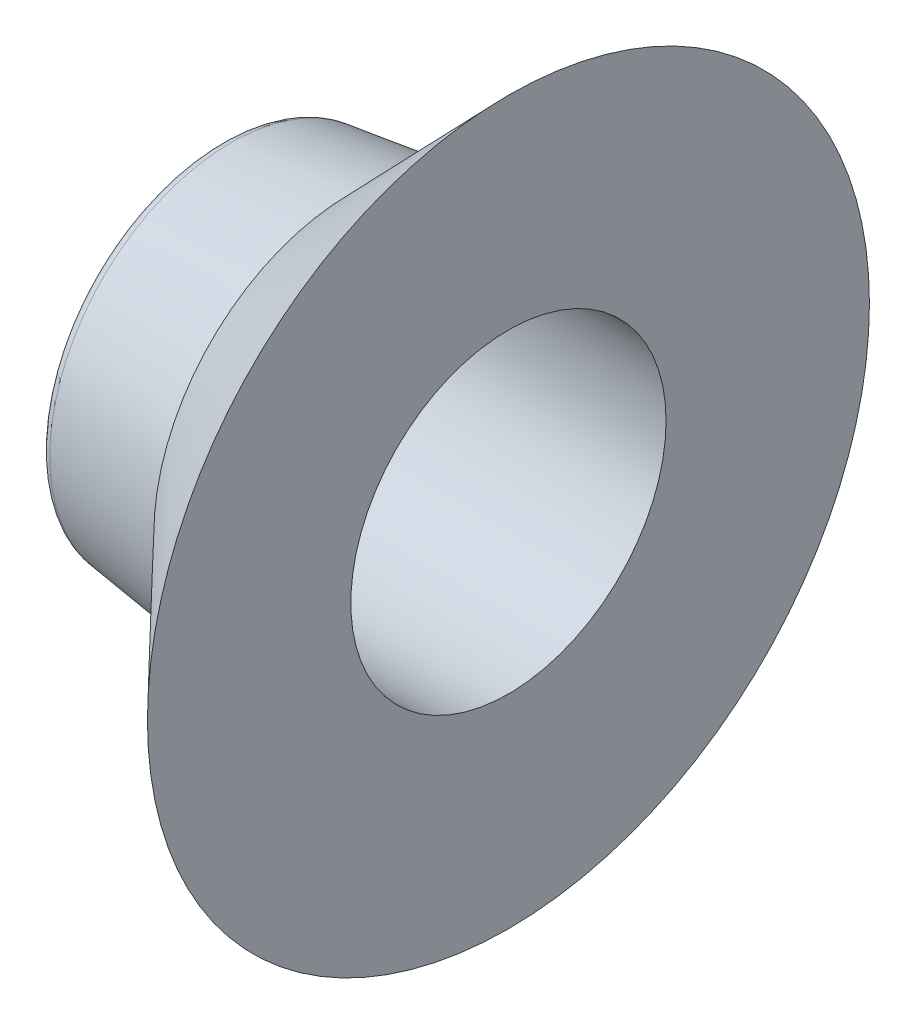
ISO-10303-21;
HEADER;
FILE_DESCRIPTION(('STEP AP214'),'2;1');
FILE_NAME('part.step','',(''),(''),'','','');
FILE_SCHEMA(('AUTOMOTIVE_DESIGN { 1 0 10303 214 1 1 1 1 }'));
ENDSEC;
DATA;
#1=APPLICATION_CONTEXT('core data for automotive mechanical design processes');
#2=APPLICATION_PROTOCOL_DEFINITION('international standard','automotive_design',2000,#1);
#3=PRODUCT_CONTEXT('',#1,'mechanical');
#4=PRODUCT('Part','Part','',(#3));
#5=PRODUCT_RELATED_PRODUCT_CATEGORY('part','',(#4));
#6=PRODUCT_DEFINITION_FORMATION('','',#4);
#7=PRODUCT_DEFINITION_CONTEXT('part definition',#1,'design');
#8=PRODUCT_DEFINITION('design','',#6,#7);
#9=PRODUCT_DEFINITION_SHAPE('','',#8);
#10=(LENGTH_UNIT() NAMED_UNIT(*) SI_UNIT(.MILLI.,.METRE.));
#11=(NAMED_UNIT(*) PLANE_ANGLE_UNIT() SI_UNIT($,.RADIAN.));
#12=(NAMED_UNIT(*) SI_UNIT($,.STERADIAN.) SOLID_ANGLE_UNIT());
#13=UNCERTAINTY_MEASURE_WITH_UNIT(LENGTH_MEASURE(1.E-05),#10,'distance_accuracy_value','');
#14=(GEOMETRIC_REPRESENTATION_CONTEXT(3) GLOBAL_UNCERTAINTY_ASSIGNED_CONTEXT((#13)) GLOBAL_UNIT_ASSIGNED_CONTEXT((#10,
#11,#12)) REPRESENTATION_CONTEXT('',''));
#15=CARTESIAN_POINT('',(0.,0.,0.));
#16=DIRECTION('',(0.,0.,1.));
#17=DIRECTION('',(1.,0.,0.));
#18=AXIS2_PLACEMENT_3D('',#15,#16,#17);
#19=CARTESIAN_POINT('',(-12.5170000000004,-35.052,0.));
#20=DIRECTION('',(1.,0.,0.));
#21=DIRECTION('',(0.,0.,-1.));
#22=AXIS2_PLACEMENT_3D('',#19,#20,#21);
#23=CONICAL_SURFACE('',#22,3.175,0.131665397972642);
#24=CARTESIAN_POINT('',(-14.4474225101529,-35.052,0.));
#25=DIRECTION('',(1.,0.,0.));
#26=DIRECTION('',(0.,0.,-1.));
#27=AXIS2_PLACEMENT_3D('',#24,#25,#26);
#28=CIRCLE('',#27,2.91935115131074);
#29=CARTESIAN_POINT('',(-14.4474225101529,-35.052,-2.91935115131074));
#30=VERTEX_POINT('',#29);
#31=EDGE_CURVE('E10',#30,#30,#28,.T.);
#32=ORIENTED_EDGE('',*,*,#31,.T.);
#33=EDGE_LOOP('',(#32));
#34=FACE_BOUND('',#33,.T.);
#35=CARTESIAN_POINT('',(-12.5170000000004,-35.052,0.));
#36=DIRECTION('',(1.,0.,0.));
#37=DIRECTION('',(0.,0.,-1.));
#38=AXIS2_PLACEMENT_3D('',#35,#36,#37);
#39=CIRCLE('',#38,3.175);
#40=CARTESIAN_POINT('',(-12.5170000000004,-35.052,-3.175));
#41=VERTEX_POINT('',#40);
#42=EDGE_CURVE('E50',#41,#41,#39,.T.);
#43=ORIENTED_EDGE('',*,*,#42,.F.);
#44=EDGE_LOOP('',(#43));
#45=FACE_BOUND('',#44,.T.);
#46=ADVANCED_FACE('F31',(#34,#45),#23,.T.);
#47=CARTESIAN_POINT('',(-14.4224126591217,-35.052,0.));
#48=DIRECTION('',(1.,0.,0.));
#49=DIRECTION('',(0.,0.,-1.));
#50=AXIS2_PLACEMENT_3D('',#47,#48,#49);
#51=TOROIDAL_SURFACE('',#50,2.7305,0.190499999999992);
#52=CARTESIAN_POINT('',(-14.4224126591217,-35.052,0.));
#53=DIRECTION('',(1.,0.,0.));
#54=DIRECTION('',(0.,0.,-1.));
#55=AXIS2_PLACEMENT_3D('',#52,#53,#54);
#56=CIRCLE('',#55,2.54);
#57=CARTESIAN_POINT('',(-14.4224126591217,-35.052,-2.54));
#58=VERTEX_POINT('',#57);
#59=EDGE_CURVE('E37',#58,#58,#56,.T.);
#60=ORIENTED_EDGE('',*,*,#59,.T.);
#61=EDGE_LOOP('',(#60));
#62=FACE_BOUND('',#61,.T.);
#63=ORIENTED_EDGE('',*,*,#31,.F.);
#64=EDGE_LOOP('',(#63));
#65=FACE_BOUND('',#64,.T.);
#66=ADVANCED_FACE('F58',(#62,#65),#51,.T.);
#67=CARTESIAN_POINT('',(-12.5170000000004,-35.052,0.));
#68=DIRECTION('',(1.,0.,0.));
#69=DIRECTION('',(0.,0.,-1.));
#70=AXIS2_PLACEMENT_3D('',#67,#68,#69);
#71=CYLINDRICAL_SURFACE('',#70,2.54);
#72=CARTESIAN_POINT('',(-9.97700000000042,-35.052,0.));
#73=DIRECTION('',(1.,0.,0.));
#74=DIRECTION('',(0.,0.,-1.));
#75=AXIS2_PLACEMENT_3D('',#72,#73,#74);
#76=CIRCLE('',#75,2.54);
#77=CARTESIAN_POINT('',(-9.97700000000042,-35.052,-2.54));
#78=VERTEX_POINT('',#77);
#79=EDGE_CURVE('E41',#78,#78,#76,.T.);
#80=ORIENTED_EDGE('',*,*,#79,.T.);
#81=EDGE_LOOP('',(#80));
#82=FACE_BOUND('',#81,.T.);
#83=ORIENTED_EDGE('',*,*,#59,.F.);
#84=EDGE_LOOP('',(#83));
#85=FACE_BOUND('',#84,.T.);
#86=ADVANCED_FACE('F62',(#82,#85),#71,.F.);
#87=CARTESIAN_POINT('',(-9.97700000000042,-32.512,0.));
#88=DIRECTION('',(1.,0.,0.));
#89=DIRECTION('',(0.,0.,-1.));
#90=AXIS2_PLACEMENT_3D('',#87,#88,#89);
#91=PLANE('',#90);
#92=CARTESIAN_POINT('',(-9.97700000000042,-35.052,0.));
#93=DIRECTION('',(1.,0.,0.));
#94=DIRECTION('',(0.,0.,-1.));
#95=AXIS2_PLACEMENT_3D('',#92,#93,#94);
#96=CIRCLE('',#95,5.8166);
#97=CARTESIAN_POINT('',(-9.97700000000042,-35.052,-5.8166));
#98=VERTEX_POINT('',#97);
#99=EDGE_CURVE('E45',#98,#98,#96,.T.);
#100=ORIENTED_EDGE('',*,*,#99,.T.);
#101=EDGE_LOOP('',(#100));
#102=FACE_BOUND('',#101,.T.);
#103=ORIENTED_EDGE('',*,*,#79,.F.);
#104=EDGE_LOOP('',(#103));
#105=FACE_BOUND('',#104,.T.);
#106=ADVANCED_FACE('F66',(#102,#105),#91,.T.);
#107=CARTESIAN_POINT('',(-9.97700000000042,-35.052,0.));
#108=DIRECTION('',(1.,0.,0.));
#109=DIRECTION('',(0.,0.,-1.));
#110=AXIS2_PLACEMENT_3D('',#107,#108,#109);
#111=CONICAL_SURFACE('',#110,5.8166,0.805003494254653);
#112=ORIENTED_EDGE('',*,*,#42,.T.);
#113=EDGE_LOOP('',(#112));
#114=FACE_BOUND('',#113,.T.);
#115=ORIENTED_EDGE('',*,*,#99,.F.);
#116=EDGE_LOOP('',(#115));
#117=FACE_BOUND('',#116,.T.);
#118=ADVANCED_FACE('F54',(#114,#117),#111,.T.);
#119=CLOSED_SHELL('',(#46,#66,#86,#106,#118));
#120=MANIFOLD_SOLID_BREP('B2',#119);
#121=ADVANCED_BREP_SHAPE_REPRESENTATION('',(#18,#120),#14);
#122=SHAPE_DEFINITION_REPRESENTATION(#9,#121);
ENDSEC;
END-ISO-10303-21;
